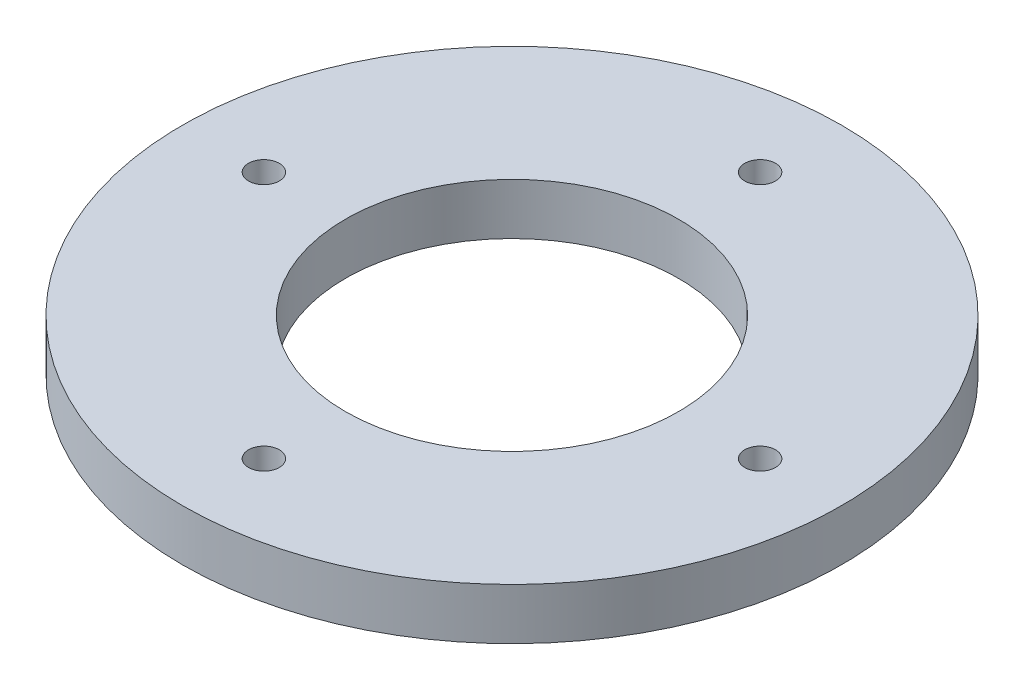
ISO-10303-21;
HEADER;
FILE_DESCRIPTION(('STEP AP214'),'2;1');
FILE_NAME('part.step','',(''),(''),'','','');
FILE_SCHEMA(('AUTOMOTIVE_DESIGN { 1 0 10303 214 1 1 1 1 }'));
ENDSEC;
DATA;
#1=APPLICATION_CONTEXT('core data for automotive mechanical design processes');
#2=APPLICATION_PROTOCOL_DEFINITION('international standard','automotive_design',2000,#1);
#3=PRODUCT_CONTEXT('',#1,'mechanical');
#4=PRODUCT('Part','Part','',(#3));
#5=PRODUCT_RELATED_PRODUCT_CATEGORY('part','',(#4));
#6=PRODUCT_DEFINITION_FORMATION('','',#4);
#7=PRODUCT_DEFINITION_CONTEXT('part definition',#1,'design');
#8=PRODUCT_DEFINITION('design','',#6,#7);
#9=PRODUCT_DEFINITION_SHAPE('','',#8);
#10=(LENGTH_UNIT() NAMED_UNIT(*) SI_UNIT(.MILLI.,.METRE.));
#11=(NAMED_UNIT(*) PLANE_ANGLE_UNIT() SI_UNIT($,.RADIAN.));
#12=(NAMED_UNIT(*) SI_UNIT($,.STERADIAN.) SOLID_ANGLE_UNIT());
#13=UNCERTAINTY_MEASURE_WITH_UNIT(LENGTH_MEASURE(1.E-05),#10,'distance_accuracy_value','');
#14=(GEOMETRIC_REPRESENTATION_CONTEXT(3) GLOBAL_UNCERTAINTY_ASSIGNED_CONTEXT((#13)) GLOBAL_UNIT_ASSIGNED_CONTEXT((#10,
#11,#12)) REPRESENTATION_CONTEXT('',''));
#15=CARTESIAN_POINT('',(0.,0.,0.));
#16=DIRECTION('',(0.,0.,1.));
#17=DIRECTION('',(1.,0.,0.));
#18=AXIS2_PLACEMENT_3D('',#15,#16,#17);
#19=CARTESIAN_POINT('',(0.,2.5,0.));
#20=DIRECTION('',(0.,1.,0.));
#21=DIRECTION('',(0.,0.,1.));
#22=AXIS2_PLACEMENT_3D('',#19,#20,#21);
#23=PLANE('',#22);
#24=CARTESIAN_POINT('',(-24.1925,2.5,0.));
#25=DIRECTION('',(0.,1.,0.));
#26=DIRECTION('',(1.,0.,0.));
#27=AXIS2_PLACEMENT_3D('',#24,#25,#26);
#28=CIRCLE('',#27,1.5);
#29=CARTESIAN_POINT('',(-22.6925,2.5,0.));
#30=VERTEX_POINT('',#29);
#31=EDGE_CURVE('E67',#30,#30,#28,.T.);
#32=ORIENTED_EDGE('',*,*,#31,.F.);
#33=EDGE_LOOP('',(#32));
#34=FACE_BOUND('',#33,.T.);
#35=CARTESIAN_POINT('',(0.,2.5,24.1925));
#36=DIRECTION('',(0.,1.,0.));
#37=DIRECTION('',(0.,0.,-1.));
#38=AXIS2_PLACEMENT_3D('',#35,#36,#37);
#39=CIRCLE('',#38,1.5);
#40=CARTESIAN_POINT('',(0.,2.5,22.6925));
#41=VERTEX_POINT('',#40);
#42=EDGE_CURVE('E61',#41,#41,#39,.T.);
#43=ORIENTED_EDGE('',*,*,#42,.F.);
#44=EDGE_LOOP('',(#43));
#45=FACE_BOUND('',#44,.T.);
#46=CARTESIAN_POINT('',(24.1925,2.5,-2.53402986869888E-13));
#47=DIRECTION('',(0.,1.,0.));
#48=DIRECTION('',(-1.,0.,0.));
#49=AXIS2_PLACEMENT_3D('',#46,#47,#48);
#50=CIRCLE('',#49,1.5);
#51=CARTESIAN_POINT('',(22.6925,2.5,-2.37691320845093E-13));
#52=VERTEX_POINT('',#51);
#53=EDGE_CURVE('E55',#52,#52,#50,.T.);
#54=ORIENTED_EDGE('',*,*,#53,.F.);
#55=EDGE_LOOP('',(#54));
#56=FACE_BOUND('',#55,.T.);
#57=CARTESIAN_POINT('',(0.,2.5,-24.1925));
#58=DIRECTION('',(0.,1.,0.));
#59=DIRECTION('',(0.,0.,1.));
#60=AXIS2_PLACEMENT_3D('',#57,#58,#59);
#61=CIRCLE('',#60,1.5);
#62=CARTESIAN_POINT('',(0.,2.5,-22.6925));
#63=VERTEX_POINT('',#62);
#64=EDGE_CURVE('E49',#63,#63,#61,.T.);
#65=ORIENTED_EDGE('',*,*,#64,.F.);
#66=EDGE_LOOP('',(#65));
#67=FACE_BOUND('',#66,.T.);
#68=CARTESIAN_POINT('',(0.,2.5,0.));
#69=DIRECTION('',(0.,1.,0.));
#70=DIRECTION('',(0.,0.,1.));
#71=AXIS2_PLACEMENT_3D('',#68,#69,#70);
#72=CIRCLE('',#71,32.135);
#73=CARTESIAN_POINT('',(0.,2.5,32.135));
#74=VERTEX_POINT('',#73);
#75=EDGE_CURVE('E10',#74,#74,#72,.T.);
#76=ORIENTED_EDGE('',*,*,#75,.T.);
#77=EDGE_LOOP('',(#76));
#78=FACE_BOUND('',#77,.T.);
#79=CARTESIAN_POINT('',(0.,2.5,0.));
#80=DIRECTION('',(0.,1.,0.));
#81=DIRECTION('',(0.,0.,1.));
#82=AXIS2_PLACEMENT_3D('',#79,#80,#81);
#83=CIRCLE('',#82,16.25);
#84=CARTESIAN_POINT('',(0.,2.5,16.25));
#85=VERTEX_POINT('',#84);
#86=EDGE_CURVE('E41',#85,#85,#83,.T.);
#87=ORIENTED_EDGE('',*,*,#86,.F.);
#88=EDGE_LOOP('',(#87));
#89=FACE_BOUND('',#88,.T.);
#90=ADVANCED_FACE('F30',(#34,#45,#56,#67,#78,#89),#23,.T.);
#91=CARTESIAN_POINT('',(0.,-2.5,0.));
#92=DIRECTION('',(0.,1.,0.));
#93=DIRECTION('',(0.,0.,1.));
#94=AXIS2_PLACEMENT_3D('',#91,#92,#93);
#95=PLANE('',#94);
#96=CARTESIAN_POINT('',(-24.1925,-2.5,0.));
#97=DIRECTION('',(0.,1.,0.));
#98=DIRECTION('',(1.,0.,0.));
#99=AXIS2_PLACEMENT_3D('',#96,#97,#98);
#100=CIRCLE('',#99,1.5);
#101=CARTESIAN_POINT('',(-22.6925,-2.5,0.));
#102=VERTEX_POINT('',#101);
#103=EDGE_CURVE('E52',#102,#102,#100,.T.);
#104=ORIENTED_EDGE('',*,*,#103,.T.);
#105=EDGE_LOOP('',(#104));
#106=FACE_BOUND('',#105,.T.);
#107=CARTESIAN_POINT('',(0.,-2.5,24.1925));
#108=DIRECTION('',(0.,1.,0.));
#109=DIRECTION('',(0.,0.,-1.));
#110=AXIS2_PLACEMENT_3D('',#107,#108,#109);
#111=CIRCLE('',#110,1.5);
#112=CARTESIAN_POINT('',(0.,-2.5,22.6925));
#113=VERTEX_POINT('',#112);
#114=EDGE_CURVE('E64',#113,#113,#111,.T.);
#115=ORIENTED_EDGE('',*,*,#114,.T.);
#116=EDGE_LOOP('',(#115));
#117=FACE_BOUND('',#116,.T.);
#118=CARTESIAN_POINT('',(24.1925,-2.5,-2.53402986869888E-13));
#119=DIRECTION('',(0.,1.,0.));
#120=DIRECTION('',(-1.,0.,0.));
#121=AXIS2_PLACEMENT_3D('',#118,#119,#120);
#122=CIRCLE('',#121,1.5);
#123=CARTESIAN_POINT('',(22.6925,-2.5,-2.37691320845093E-13));
#124=VERTEX_POINT('',#123);
#125=EDGE_CURVE('E58',#124,#124,#122,.T.);
#126=ORIENTED_EDGE('',*,*,#125,.T.);
#127=EDGE_LOOP('',(#126));
#128=FACE_BOUND('',#127,.T.);
#129=CARTESIAN_POINT('',(0.,-2.5,-24.1925));
#130=DIRECTION('',(0.,1.,0.));
#131=DIRECTION('',(0.,0.,1.));
#132=AXIS2_PLACEMENT_3D('',#129,#130,#131);
#133=CIRCLE('',#132,1.5);
#134=CARTESIAN_POINT('',(0.,-2.5,-22.6925));
#135=VERTEX_POINT('',#134);
#136=EDGE_CURVE('E46',#135,#135,#133,.T.);
#137=ORIENTED_EDGE('',*,*,#136,.T.);
#138=EDGE_LOOP('',(#137));
#139=FACE_BOUND('',#138,.T.);
#140=CARTESIAN_POINT('',(0.,-2.5,0.));
#141=DIRECTION('',(0.,1.,0.));
#142=DIRECTION('',(0.,0.,1.));
#143=AXIS2_PLACEMENT_3D('',#140,#141,#142);
#144=CIRCLE('',#143,32.135);
#145=CARTESIAN_POINT('',(0.,-2.5,32.135));
#146=VERTEX_POINT('',#145);
#147=EDGE_CURVE('E34',#146,#146,#144,.T.);
#148=ORIENTED_EDGE('',*,*,#147,.F.);
#149=EDGE_LOOP('',(#148));
#150=FACE_BOUND('',#149,.T.);
#151=CARTESIAN_POINT('',(0.,-2.5,0.));
#152=DIRECTION('',(0.,1.,0.));
#153=DIRECTION('',(0.,0.,1.));
#154=AXIS2_PLACEMENT_3D('',#151,#152,#153);
#155=CIRCLE('',#154,16.25);
#156=CARTESIAN_POINT('',(0.,-2.5,16.25));
#157=VERTEX_POINT('',#156);
#158=EDGE_CURVE('E43',#157,#157,#155,.T.);
#159=ORIENTED_EDGE('',*,*,#158,.T.);
#160=EDGE_LOOP('',(#159));
#161=FACE_BOUND('',#160,.T.);
#162=ADVANCED_FACE('F73',(#106,#117,#128,#139,#150,#161),#95,.F.);
#163=CARTESIAN_POINT('',(0.,2.5,0.));
#164=DIRECTION('',(0.,-1.,0.));
#165=DIRECTION('',(0.,0.,-1.));
#166=AXIS2_PLACEMENT_3D('',#163,#164,#165);
#167=CYLINDRICAL_SURFACE('',#166,32.135);
#168=ORIENTED_EDGE('',*,*,#75,.F.);
#169=EDGE_LOOP('',(#168));
#170=FACE_BOUND('',#169,.T.);
#171=ORIENTED_EDGE('',*,*,#147,.T.);
#172=EDGE_LOOP('',(#171));
#173=FACE_BOUND('',#172,.T.);
#174=ADVANCED_FACE('F32',(#170,#173),#167,.T.);
#175=CARTESIAN_POINT('',(0.,2.5,0.));
#176=DIRECTION('',(0.,-1.,0.));
#177=DIRECTION('',(0.,0.,-1.));
#178=AXIS2_PLACEMENT_3D('',#175,#176,#177);
#179=CYLINDRICAL_SURFACE('',#178,16.25);
#180=ORIENTED_EDGE('',*,*,#86,.T.);
#181=EDGE_LOOP('',(#180));
#182=FACE_BOUND('',#181,.T.);
#183=ORIENTED_EDGE('',*,*,#158,.F.);
#184=EDGE_LOOP('',(#183));
#185=FACE_BOUND('',#184,.T.);
#186=ADVANCED_FACE('F94',(#182,#185),#179,.F.);
#187=CARTESIAN_POINT('',(0.,-2.5,-24.1925));
#188=DIRECTION('',(0.,1.,0.));
#189=DIRECTION('',(0.,0.,1.));
#190=AXIS2_PLACEMENT_3D('',#187,#188,#189);
#191=CYLINDRICAL_SURFACE('',#190,1.5);
#192=ORIENTED_EDGE('',*,*,#136,.F.);
#193=EDGE_LOOP('',(#192));
#194=FACE_BOUND('',#193,.T.);
#195=ORIENTED_EDGE('',*,*,#64,.T.);
#196=EDGE_LOOP('',(#195));
#197=FACE_BOUND('',#196,.T.);
#198=ADVANCED_FACE('F97',(#194,#197),#191,.F.);
#199=CARTESIAN_POINT('',(24.1925,-2.5,-2.53402986869888E-13));
#200=DIRECTION('',(0.,1.,0.));
#201=DIRECTION('',(0.,0.,1.));
#202=AXIS2_PLACEMENT_3D('',#199,#200,#201);
#203=CYLINDRICAL_SURFACE('',#202,1.5);
#204=ORIENTED_EDGE('',*,*,#125,.F.);
#205=EDGE_LOOP('',(#204));
#206=FACE_BOUND('',#205,.T.);
#207=ORIENTED_EDGE('',*,*,#53,.T.);
#208=EDGE_LOOP('',(#207));
#209=FACE_BOUND('',#208,.T.);
#210=ADVANCED_FACE('F109',(#206,#209),#203,.F.);
#211=CARTESIAN_POINT('',(0.,-2.5,24.1925));
#212=DIRECTION('',(0.,1.,0.));
#213=DIRECTION('',(0.,0.,1.));
#214=AXIS2_PLACEMENT_3D('',#211,#212,#213);
#215=CYLINDRICAL_SURFACE('',#214,1.5);
#216=ORIENTED_EDGE('',*,*,#114,.F.);
#217=EDGE_LOOP('',(#216));
#218=FACE_BOUND('',#217,.T.);
#219=ORIENTED_EDGE('',*,*,#42,.T.);
#220=EDGE_LOOP('',(#219));
#221=FACE_BOUND('',#220,.T.);
#222=ADVANCED_FACE('F79',(#218,#221),#215,.F.);
#223=CARTESIAN_POINT('',(-24.1925,-2.5,0.));
#224=DIRECTION('',(0.,1.,0.));
#225=DIRECTION('',(0.,0.,1.));
#226=AXIS2_PLACEMENT_3D('',#223,#224,#225);
#227=CYLINDRICAL_SURFACE('',#226,1.5);
#228=ORIENTED_EDGE('',*,*,#103,.F.);
#229=EDGE_LOOP('',(#228));
#230=FACE_BOUND('',#229,.T.);
#231=ORIENTED_EDGE('',*,*,#31,.T.);
#232=EDGE_LOOP('',(#231));
#233=FACE_BOUND('',#232,.T.);
#234=ADVANCED_FACE('F76',(#230,#233),#227,.F.);
#235=CLOSED_SHELL('',(#90,#162,#174,#186,#198,#210,#222,#234));
#236=MANIFOLD_SOLID_BREP('B2',#235);
#237=ADVANCED_BREP_SHAPE_REPRESENTATION('',(#18,#236),#14);
#238=SHAPE_DEFINITION_REPRESENTATION(#9,#237);
ENDSEC;
END-ISO-10303-21;
